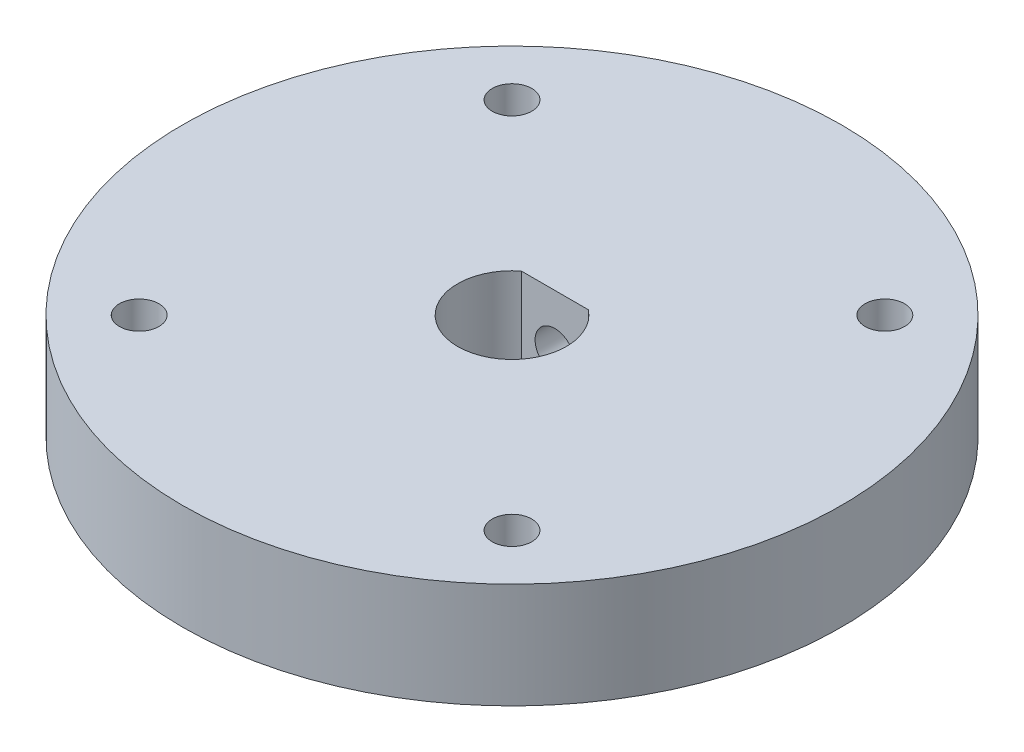
ISO-10303-21;
HEADER;
FILE_DESCRIPTION(('STEP AP214'),'2;1');
FILE_NAME('part.step','',(''),(''),'','','');
FILE_SCHEMA(('AUTOMOTIVE_DESIGN { 1 0 10303 214 1 1 1 1 }'));
ENDSEC;
DATA;
#1=APPLICATION_CONTEXT('core data for automotive mechanical design processes');
#2=APPLICATION_PROTOCOL_DEFINITION('international standard','automotive_design',2000,#1);
#3=PRODUCT_CONTEXT('',#1,'mechanical');
#4=PRODUCT('Part','Part','',(#3));
#5=PRODUCT_RELATED_PRODUCT_CATEGORY('part','',(#4));
#6=PRODUCT_DEFINITION_FORMATION('','',#4);
#7=PRODUCT_DEFINITION_CONTEXT('part definition',#1,'design');
#8=PRODUCT_DEFINITION('design','',#6,#7);
#9=PRODUCT_DEFINITION_SHAPE('','',#8);
#10=(LENGTH_UNIT() NAMED_UNIT(*) SI_UNIT(.MILLI.,.METRE.));
#11=(NAMED_UNIT(*) PLANE_ANGLE_UNIT() SI_UNIT($,.RADIAN.));
#12=(NAMED_UNIT(*) SI_UNIT($,.STERADIAN.) SOLID_ANGLE_UNIT());
#13=UNCERTAINTY_MEASURE_WITH_UNIT(LENGTH_MEASURE(1.E-05),#10,'distance_accuracy_value','');
#14=(GEOMETRIC_REPRESENTATION_CONTEXT(3) GLOBAL_UNCERTAINTY_ASSIGNED_CONTEXT((#13)) GLOBAL_UNIT_ASSIGNED_CONTEXT((#10,
#11,#12)) REPRESENTATION_CONTEXT('',''));
#15=CARTESIAN_POINT('',(0.,0.,0.));
#16=DIRECTION('',(0.,0.,1.));
#17=DIRECTION('',(1.,0.,0.));
#18=AXIS2_PLACEMENT_3D('',#15,#16,#17);
#19=CARTESIAN_POINT('',(0.,8.,0.));
#20=DIRECTION('',(0.,-1.,0.));
#21=DIRECTION('',(0.,0.,-1.));
#22=AXIS2_PLACEMENT_3D('',#19,#20,#21);
#23=CYLINDRICAL_SURFACE('',#22,25.);
#24=CARTESIAN_POINT('',(0.,0.,0.));
#25=DIRECTION('',(0.,1.,0.));
#26=DIRECTION('',(0.,0.,1.));
#27=AXIS2_PLACEMENT_3D('',#24,#25,#26);
#28=CIRCLE('',#27,25.);
#29=CARTESIAN_POINT('',(0.,0.,25.));
#30=VERTEX_POINT('',#29);
#31=EDGE_CURVE('E53',#30,#30,#28,.T.);
#32=ORIENTED_EDGE('',*,*,#31,.T.);
#33=EDGE_LOOP('',(#32));
#34=FACE_BOUND('',#33,.T.);
#35=CARTESIAN_POINT('',(0.,8.,0.));
#36=DIRECTION('',(0.,1.,0.));
#37=DIRECTION('',(0.,0.,1.));
#38=AXIS2_PLACEMENT_3D('',#35,#36,#37);
#39=CIRCLE('',#38,25.);
#40=CARTESIAN_POINT('',(0.,8.,25.));
#41=VERTEX_POINT('',#40);
#42=EDGE_CURVE('E11',#41,#41,#39,.T.);
#43=ORIENTED_EDGE('',*,*,#42,.F.);
#44=EDGE_LOOP('',(#43));
#45=FACE_BOUND('',#44,.T.);
#46=CARTESIAN_POINT('',(0.,6.5403001791127,-25.));
#47=CARTESIAN_POINT('',(0.142296173163742,6.540294023206,-24.9999983385396));
#48=CARTESIAN_POINT('',(0.284686127401418,6.52830373562857,-24.99877220319));
#49=CARTESIAN_POINT('',(0.565517585096987,6.48065361274378,-24.9939988119328));
#50=CARTESIAN_POINT('',(0.703954577212125,6.44496777899313,-24.9904490065857));
#51=CARTESIAN_POINT('',(0.972772794523899,6.35097689727402,-24.9814289381469));
#52=CARTESIAN_POINT('',(1.10315886168489,6.29268560128362,-24.9759598428425));
#53=CARTESIAN_POINT('',(1.35226813750984,6.15516536865815,-24.9637125453824));
#54=CARTESIAN_POINT('',(1.47099364048516,6.07594056222888,-24.9569346015349));
#55=CARTESIAN_POINT('',(1.69388023038557,5.89848689257549,-24.9428006047637));
#56=CARTESIAN_POINT('',(1.7979919813956,5.80019620229791,-24.9354427185724));
#57=CARTESIAN_POINT('',(1.98827163016278,5.58753281046018,-24.9209932540018));
#58=CARTESIAN_POINT('',(2.07443869331246,5.47315936130516,-24.9139016880215));
#59=CARTESIAN_POINT('',(2.22655827675972,5.23126759400491,-24.9007690946797));
#60=CARTESIAN_POINT('',(2.29246605736723,5.10372100240584,-24.8947304049813));
#61=CARTESIAN_POINT('',(2.40191051525527,4.83929947985331,-24.8844100920088));
#62=CARTESIAN_POINT('',(2.44544776214454,4.70242478651677,-24.8801284239973));
#63=CARTESIAN_POINT('',(2.50876880713539,4.42373613976118,-24.8738235609723));
#64=CARTESIAN_POINT('',(2.52863452275869,4.28194097800913,-24.8717925789703));
#65=CARTESIAN_POINT('',(2.54430182767479,3.99701562167174,-24.8701948845832));
#66=CARTESIAN_POINT('',(2.54010406876178,3.85388546335156,-24.8706281054517));
#67=CARTESIAN_POINT('',(2.50783108659309,3.57091809625692,-24.8739027569794));
#68=CARTESIAN_POINT('',(2.47984535192711,3.4310705619905,-24.8767351619485));
#69=CARTESIAN_POINT('',(2.40093009467778,3.15806763051647,-24.8844749426093));
#70=CARTESIAN_POINT('',(2.35000025309315,3.02491232638229,-24.8893823471506));
#71=CARTESIAN_POINT('',(2.22654386588512,2.76879122991967,-24.9007295614281));
#72=CARTESIAN_POINT('',(2.15397766450597,2.6458446821247,-24.9071721805589));
#73=CARTESIAN_POINT('',(1.98933693424774,2.41384170605886,-24.9208615369364));
#74=CARTESIAN_POINT('',(1.89726181573716,2.30478569777095,-24.9281082984841));
#75=CARTESIAN_POINT('',(1.69571733393291,2.10313951985693,-24.942629622861));
#76=CARTESIAN_POINT('',(1.58617069473245,2.01062656789319,-24.9499041620718));
#77=CARTESIAN_POINT('',(1.35306100050723,1.84529126090176,-24.9636302454488));
#78=CARTESIAN_POINT('',(1.22949792898245,1.77246892905401,-24.9700817886462));
#79=CARTESIAN_POINT('',(0.971809023101519,1.64858493639978,-24.981437184215));
#80=CARTESIAN_POINT('',(0.83768126653888,1.59752724647775,-24.9863407541217));
#81=CARTESIAN_POINT('',(0.562695845938416,1.51867874241371,-24.994044838092));
#82=CARTESIAN_POINT('',(0.421838389857855,1.49088720980537,-24.9968454170963));
#83=CARTESIAN_POINT('',(0.138060644344315,1.45945800298242,-25.0000196196596));
#84=CARTESIAN_POINT('',(-0.00484773025709483,1.45571378474179,-25.0004039484959));
#85=CARTESIAN_POINT('',(-0.2892577212237,1.4722055787322,-24.9987310638568));
#86=CARTESIAN_POINT('',(-0.430759357194882,1.49244125627702,-24.9966738844572));
#87=CARTESIAN_POINT('',(-0.708031244601215,1.5562300277586,-24.9903559933151));
#88=CARTESIAN_POINT('',(-0.843813101651551,1.5997331823807,-24.9861000015779));
#89=CARTESIAN_POINT('',(-1.10615196773859,1.70877065666869,-24.9758618917787));
#90=CARTESIAN_POINT('',(-1.2327087635175,1.7743054854493,-24.9698797338285));
#91=CARTESIAN_POINT('',(-1.4734864035579,1.92580986963512,-24.9568316343041));
#92=CARTESIAN_POINT('',(-1.58766303803267,2.01184936325064,-24.9497620134835));
#93=CARTESIAN_POINT('',(-1.79999165488946,2.20182052943254,-24.9353439370307));
#94=CARTESIAN_POINT('',(-1.89814322162904,2.30575266593711,-24.9279954741723));
#95=CARTESIAN_POINT('',(-2.07600594404032,2.52902401135919,-24.9138156756389));
#96=CARTESIAN_POINT('',(-2.15564713350089,2.64841910367593,-24.906986365655));
#97=CARTESIAN_POINT('',(-2.29374726258629,2.898951795116,-24.8946490445467));
#98=CARTESIAN_POINT('',(-2.35220649999214,3.03008922913031,-24.8891410148478));
#99=CARTESIAN_POINT('',(-2.44616637423158,3.30014497013413,-24.8800825847812));
#100=CARTESIAN_POINT('',(-2.48170851426286,3.43904871343549,-24.8765286472534));
#101=CARTESIAN_POINT('',(-2.52895988977141,3.72089048823332,-24.8717698380494));
#102=CARTESIAN_POINT('',(-2.54066983300974,3.86382839979652,-24.8705648966135));
#103=CARTESIAN_POINT('',(-2.5399144068568,4.14898557622737,-24.8706420026341));
#104=CARTESIAN_POINT('',(-2.52755894520311,4.29120514807172,-24.8719127435494));
#105=CARTESIAN_POINT('',(-2.47925401313301,4.57153699199068,-24.8767739127993));
#106=CARTESIAN_POINT('',(-2.44330451733255,4.7096492596462,-24.8803643436296));
#107=CARTESIAN_POINT('',(-2.34886255647417,4.97784436608672,-24.8894571824873));
#108=CARTESIAN_POINT('',(-2.2903734392122,5.10792839397388,-24.8949593065602));
#109=CARTESIAN_POINT('',(-2.15252382001654,5.35645062393997,-24.9072561459216));
#110=CARTESIAN_POINT('',(-2.07316341275773,5.47488887884229,-24.9140508553466));
#111=CARTESIAN_POINT('',(-1.8954114441295,5.6973207609155,-24.928204446376));
#112=CARTESIAN_POINT('',(-1.79693796890177,5.80124878099475,-24.9355656709006));
#113=CARTESIAN_POINT('',(-1.58391803230031,5.991153188596,-24.9500015072705));
#114=CARTESIAN_POINT('',(-1.46936773040669,6.07712527446075,-24.9570760501098));
#115=CARTESIAN_POINT('',(-1.2271201270444,6.22885352375491,-24.9701605375219));
#116=CARTESIAN_POINT('',(-1.09938954628952,6.29455675621915,-24.9761676775939));
#117=CARTESIAN_POINT('',(-0.834728662450881,6.40349463024192,-24.9864101874646));
#118=CARTESIAN_POINT('',(-0.697808907501244,6.44675455235564,-24.9906475497194));
#119=CARTESIAN_POINT('',(-0.466764791805179,6.49881571128828,-24.9958108407278));
#120=CARTESIAN_POINT('',(-0.374116304635257,6.514351068132,-24.9973744311634));
#121=CARTESIAN_POINT('',(-0.187658806295788,6.53509530991178,-24.9994695564832));
#122=CARTESIAN_POINT('',(-0.0938498001090526,6.54030423916998,-25.0000010957971));
#123=CARTESIAN_POINT('',(0.,6.5403001791127,-25.));
#124=B_SPLINE_CURVE_WITH_KNOTS('',3,(#46,#47,#48,#49,#50,#51,#52,#53,#54,#55,#56,#57,#58,#59,
#60,#61,#62,#63,#64,#65,#66,#67,#68,#69,#70,#71,#72,#73,#74,#75,#76,#77,#78,#79,#80,#81,#82,#83,
#84,#85,#86,#87,#88,#89,#90,#91,#92,#93,#94,#95,#96,#97,#98,#99,#100,#101,#102,#103,#104,#105,
#106,#107,#108,#109,#110,#111,#112,#113,#114,#115,#116,#117,#118,#119,#120,#121,#122,#123),
.UNSPECIFIED.,.T.,.F.,(4,2,2,2,2,2,2,2,2,2,2,2,2,2,2,2,2,2,2,2,2,2,2,2,2,2,2,2,2,2,2,2,2,2,2,2,
2,2,4),(0.,0.42654580946566,0.8535603944395,1.2803156126085,1.7069866942707,2.13506524621548,
2.56316370365006,2.99220087287207,3.42122711721235,3.8487643243204,4.27628995101641,
4.70221434024446,5.12814465145593,5.55486046991908,5.98158918714992,6.41026050665011,
6.83893233078312,7.26768233118449,7.69641909116091,8.12325497205539,8.55008489569268,
8.97600236309114,9.40192967339815,9.82933108896018,10.2567435882793,10.6857462766038,
11.11474293367,11.5429604730357,11.9711652951463,12.3974190723693,12.8236733081855,
13.2498642571119,13.6760532728141,14.1041108532375,14.5322708649911,14.961539707907,
15.3903239589172,15.6716485362768,15.9529719061586),.UNSPECIFIED.);
#125=CARTESIAN_POINT('',(0.,6.5403001791127,-25.));
#126=VERTEX_POINT('',#125);
#127=EDGE_CURVE('E43',#126,#126,#124,.T.);
#128=ORIENTED_EDGE('',*,*,#127,.F.);
#129=EDGE_LOOP('',(#128));
#130=FACE_BOUND('',#129,.T.);
#131=ADVANCED_FACE('F39',(#34,#45,#130),#23,.T.);
#132=CARTESIAN_POINT('',(0.,8.,0.));
#133=DIRECTION('',(0.,1.,0.));
#134=DIRECTION('',(0.,0.,1.));
#135=AXIS2_PLACEMENT_3D('',#132,#133,#134);
#136=PLANE('',#135);
#137=CARTESIAN_POINT('',(14.1421356237311,8.,-14.1421356237308));
#138=DIRECTION('',(0.,1.,0.));
#139=DIRECTION('',(0.,0.,1.));
#140=AXIS2_PLACEMENT_3D('',#137,#138,#139);
#141=CIRCLE('',#140,1.5);
#142=CARTESIAN_POINT('',(14.1421356237311,8.,-12.6421356237308));
#143=VERTEX_POINT('',#142);
#144=EDGE_CURVE('E130',#143,#143,#141,.T.);
#145=ORIENTED_EDGE('',*,*,#144,.F.);
#146=EDGE_LOOP('',(#145));
#147=FACE_BOUND('',#146,.T.);
#148=CARTESIAN_POINT('',(-14.142135623731,8.,14.1421356237309));
#149=DIRECTION('',(0.,1.,0.));
#150=DIRECTION('',(0.,0.,1.));
#151=AXIS2_PLACEMENT_3D('',#148,#149,#150);
#152=CIRCLE('',#151,1.5);
#153=CARTESIAN_POINT('',(-14.142135623731,8.,15.6421356237309));
#154=VERTEX_POINT('',#153);
#155=EDGE_CURVE('E89',#154,#154,#152,.T.);
#156=ORIENTED_EDGE('',*,*,#155,.F.);
#157=EDGE_LOOP('',(#156));
#158=FACE_BOUND('',#157,.T.);
#159=ORIENTED_EDGE('',*,*,#42,.T.);
#160=EDGE_LOOP('',(#159));
#161=FACE_BOUND('',#160,.T.);
#162=DIRECTION('',(-1.,0.,0.));
#163=VECTOR('',#162,1.);
#164=CARTESIAN_POINT('',(2.5403001791127,8.,-3.25));
#165=LINE('',#164,#163);
#166=CARTESIAN_POINT('',(2.5403001791127,8.,-3.25));
#167=VERTEX_POINT('',#166);
#168=CARTESIAN_POINT('',(-2.5403001791127,8.,-3.25));
#169=VERTEX_POINT('',#168);
#170=EDGE_CURVE('E96',#167,#169,#165,.T.);
#171=ORIENTED_EDGE('',*,*,#170,.F.);
#172=CARTESIAN_POINT('',(0.,8.,0.));
#173=DIRECTION('',(0.,1.,0.));
#174=DIRECTION('',(0.,0.,1.));
#175=AXIS2_PLACEMENT_3D('',#172,#173,#174);
#176=CIRCLE('',#175,4.125);
#177=EDGE_CURVE('E79',#169,#167,#176,.T.);
#178=ORIENTED_EDGE('',*,*,#177,.F.);
#179=EDGE_LOOP('',(#171,#178));
#180=FACE_BOUND('',#179,.T.);
#181=CARTESIAN_POINT('',(-14.1421356237309,8.,-14.142135623731));
#182=DIRECTION('',(0.,1.,0.));
#183=DIRECTION('',(0.,0.,1.));
#184=AXIS2_PLACEMENT_3D('',#181,#182,#183);
#185=CIRCLE('',#184,1.5);
#186=CARTESIAN_POINT('',(-14.1421356237309,8.,-12.642135623731));
#187=VERTEX_POINT('',#186);
#188=EDGE_CURVE('E138',#187,#187,#185,.T.);
#189=ORIENTED_EDGE('',*,*,#188,.F.);
#190=EDGE_LOOP('',(#189));
#191=FACE_BOUND('',#190,.T.);
#192=CARTESIAN_POINT('',(14.1421356237308,8.,14.1421356237311));
#193=DIRECTION('',(0.,1.,0.));
#194=DIRECTION('',(0.,0.,1.));
#195=AXIS2_PLACEMENT_3D('',#192,#193,#194);
#196=CIRCLE('',#195,1.5);
#197=CARTESIAN_POINT('',(14.1421356237308,8.,15.6421356237311));
#198=VERTEX_POINT('',#197);
#199=EDGE_CURVE('E122',#198,#198,#196,.T.);
#200=ORIENTED_EDGE('',*,*,#199,.F.);
#201=EDGE_LOOP('',(#200));
#202=FACE_BOUND('',#201,.T.);
#203=ADVANCED_FACE('F150',(#147,#158,#161,#180,#191,#202),#136,.T.);
#204=CARTESIAN_POINT('',(0.,0.,0.));
#205=DIRECTION('',(0.,1.,0.));
#206=DIRECTION('',(0.,0.,1.));
#207=AXIS2_PLACEMENT_3D('',#204,#205,#206);
#208=PLANE('',#207);
#209=ORIENTED_EDGE('',*,*,#31,.F.);
#210=EDGE_LOOP('',(#209));
#211=FACE_BOUND('',#210,.T.);
#212=CARTESIAN_POINT('',(0.,0.,0.));
#213=DIRECTION('',(0.,1.,0.));
#214=DIRECTION('',(0.,0.,1.));
#215=AXIS2_PLACEMENT_3D('',#212,#213,#214);
#216=CIRCLE('',#215,4.125);
#217=CARTESIAN_POINT('',(-2.5403001791127,0.,-3.25));
#218=VERTEX_POINT('',#217);
#219=CARTESIAN_POINT('',(2.5403001791127,0.,-3.25));
#220=VERTEX_POINT('',#219);
#221=EDGE_CURVE('E68',#218,#220,#216,.T.);
#222=ORIENTED_EDGE('',*,*,#221,.T.);
#223=DIRECTION('',(-1.,0.,0.));
#224=VECTOR('',#223,1.);
#225=CARTESIAN_POINT('',(2.5403001791127,0.,-3.25));
#226=LINE('',#225,#224);
#227=EDGE_CURVE('E74',#220,#218,#226,.T.);
#228=ORIENTED_EDGE('',*,*,#227,.T.);
#229=EDGE_LOOP('',(#222,#228));
#230=FACE_BOUND('',#229,.T.);
#231=CARTESIAN_POINT('',(-14.142135623731,0.,14.1421356237309));
#232=DIRECTION('',(0.,1.,0.));
#233=DIRECTION('',(0.,0.,1.));
#234=AXIS2_PLACEMENT_3D('',#231,#232,#233);
#235=CIRCLE('',#234,1.5);
#236=CARTESIAN_POINT('',(-14.142135623731,0.,15.6421356237309));
#237=VERTEX_POINT('',#236);
#238=EDGE_CURVE('E93',#237,#237,#235,.T.);
#239=ORIENTED_EDGE('',*,*,#238,.T.);
#240=EDGE_LOOP('',(#239));
#241=FACE_BOUND('',#240,.T.);
#242=CARTESIAN_POINT('',(-14.1421356237309,0.,-14.142135623731));
#243=DIRECTION('',(0.,1.,0.));
#244=DIRECTION('',(0.,0.,1.));
#245=AXIS2_PLACEMENT_3D('',#242,#243,#244);
#246=CIRCLE('',#245,1.5);
#247=CARTESIAN_POINT('',(-14.1421356237309,0.,-12.642135623731));
#248=VERTEX_POINT('',#247);
#249=EDGE_CURVE('E134',#248,#248,#246,.T.);
#250=ORIENTED_EDGE('',*,*,#249,.T.);
#251=EDGE_LOOP('',(#250));
#252=FACE_BOUND('',#251,.T.);
#253=CARTESIAN_POINT('',(14.1421356237311,0.,-14.1421356237308));
#254=DIRECTION('',(0.,1.,0.));
#255=DIRECTION('',(0.,0.,1.));
#256=AXIS2_PLACEMENT_3D('',#253,#254,#255);
#257=CIRCLE('',#256,1.5);
#258=CARTESIAN_POINT('',(14.1421356237311,0.,-12.6421356237308));
#259=VERTEX_POINT('',#258);
#260=EDGE_CURVE('E126',#259,#259,#257,.T.);
#261=ORIENTED_EDGE('',*,*,#260,.T.);
#262=EDGE_LOOP('',(#261));
#263=FACE_BOUND('',#262,.T.);
#264=CARTESIAN_POINT('',(14.1421356237308,0.,14.1421356237311));
#265=DIRECTION('',(0.,1.,0.));
#266=DIRECTION('',(0.,0.,1.));
#267=AXIS2_PLACEMENT_3D('',#264,#265,#266);
#268=CIRCLE('',#267,1.5);
#269=CARTESIAN_POINT('',(14.1421356237308,0.,15.6421356237311));
#270=VERTEX_POINT('',#269);
#271=EDGE_CURVE('E121',#270,#270,#268,.T.);
#272=ORIENTED_EDGE('',*,*,#271,.T.);
#273=EDGE_LOOP('',(#272));
#274=FACE_BOUND('',#273,.T.);
#275=ADVANCED_FACE('F86',(#211,#230,#241,#252,#263,#274),#208,.F.);
#276=CARTESIAN_POINT('',(0.,8.,0.));
#277=DIRECTION('',(0.,-1.,0.));
#278=DIRECTION('',(0.,0.,-1.));
#279=AXIS2_PLACEMENT_3D('',#276,#277,#278);
#280=CYLINDRICAL_SURFACE('',#279,4.125);
#281=ORIENTED_EDGE('',*,*,#221,.F.);
#282=DIRECTION('',(0.,-1.,0.));
#283=VECTOR('',#282,1.);
#284=CARTESIAN_POINT('',(-2.5403001791127,8.,-3.25));
#285=LINE('',#284,#283);
#286=EDGE_CURVE('E76',#169,#218,#285,.T.);
#287=ORIENTED_EDGE('',*,*,#286,.F.);
#288=ORIENTED_EDGE('',*,*,#177,.T.);
#289=DIRECTION('',(0.,-1.,0.));
#290=VECTOR('',#289,1.);
#291=CARTESIAN_POINT('',(2.5403001791127,8.,-3.25));
#292=LINE('',#291,#290);
#293=EDGE_CURVE('E61',#167,#220,#292,.T.);
#294=ORIENTED_EDGE('',*,*,#293,.T.);
#295=EDGE_LOOP('',(#281,#287,#288,#294));
#296=FACE_BOUND('',#295,.T.);
#297=ADVANCED_FACE('F81',(#296),#280,.F.);
#298=CARTESIAN_POINT('',(2.5403001791127,8.,-3.25));
#299=DIRECTION('',(0.,0.,1.));
#300=DIRECTION('',(1.,0.,0.));
#301=AXIS2_PLACEMENT_3D('',#298,#299,#300);
#302=PLANE('',#301);
#303=CARTESIAN_POINT('',(0.,4.,-3.25));
#304=DIRECTION('',(0.,0.,1.));
#305=DIRECTION('',(1.,0.,0.));
#306=AXIS2_PLACEMENT_3D('',#303,#304,#305);
#307=CIRCLE('',#306,1.5);
#308=CARTESIAN_POINT('',(1.5,4.,-3.25));
#309=VERTEX_POINT('',#308);
#310=EDGE_CURVE('E112',#309,#309,#307,.T.);
#311=ORIENTED_EDGE('',*,*,#310,.F.);
#312=EDGE_LOOP('',(#311));
#313=FACE_BOUND('',#312,.T.);
#314=ORIENTED_EDGE('',*,*,#227,.F.);
#315=ORIENTED_EDGE('',*,*,#293,.F.);
#316=ORIENTED_EDGE('',*,*,#170,.T.);
#317=ORIENTED_EDGE('',*,*,#286,.T.);
#318=EDGE_LOOP('',(#314,#315,#316,#317));
#319=FACE_BOUND('',#318,.T.);
#320=ADVANCED_FACE('F75',(#313,#319),#302,.T.);
#321=CARTESIAN_POINT('',(-14.142135623731,8.,14.1421356237309));
#322=DIRECTION('',(0.,-1.,0.));
#323=DIRECTION('',(0.,0.,-1.));
#324=AXIS2_PLACEMENT_3D('',#321,#322,#323);
#325=CYLINDRICAL_SURFACE('',#324,1.5);
#326=ORIENTED_EDGE('',*,*,#155,.T.);
#327=EDGE_LOOP('',(#326));
#328=FACE_BOUND('',#327,.T.);
#329=ORIENTED_EDGE('',*,*,#238,.F.);
#330=EDGE_LOOP('',(#329));
#331=FACE_BOUND('',#330,.T.);
#332=ADVANCED_FACE('F201',(#328,#331),#325,.F.);
#333=CARTESIAN_POINT('',(-14.1421356237309,8.,-14.142135623731));
#334=DIRECTION('',(0.,-1.,0.));
#335=DIRECTION('',(0.,0.,-1.));
#336=AXIS2_PLACEMENT_3D('',#333,#334,#335);
#337=CYLINDRICAL_SURFACE('',#336,1.5);
#338=ORIENTED_EDGE('',*,*,#188,.T.);
#339=EDGE_LOOP('',(#338));
#340=FACE_BOUND('',#339,.T.);
#341=ORIENTED_EDGE('',*,*,#249,.F.);
#342=EDGE_LOOP('',(#341));
#343=FACE_BOUND('',#342,.T.);
#344=ADVANCED_FACE('F197',(#340,#343),#337,.F.);
#345=CARTESIAN_POINT('',(14.1421356237311,8.,-14.1421356237308));
#346=DIRECTION('',(0.,-1.,0.));
#347=DIRECTION('',(0.,0.,-1.));
#348=AXIS2_PLACEMENT_3D('',#345,#346,#347);
#349=CYLINDRICAL_SURFACE('',#348,1.5);
#350=ORIENTED_EDGE('',*,*,#144,.T.);
#351=EDGE_LOOP('',(#350));
#352=FACE_BOUND('',#351,.T.);
#353=ORIENTED_EDGE('',*,*,#260,.F.);
#354=EDGE_LOOP('',(#353));
#355=FACE_BOUND('',#354,.T.);
#356=ADVANCED_FACE('F163',(#352,#355),#349,.F.);
#357=CARTESIAN_POINT('',(14.1421356237308,8.,14.1421356237311));
#358=DIRECTION('',(0.,-1.,0.));
#359=DIRECTION('',(0.,0.,-1.));
#360=AXIS2_PLACEMENT_3D('',#357,#358,#359);
#361=CYLINDRICAL_SURFACE('',#360,1.5);
#362=ORIENTED_EDGE('',*,*,#199,.T.);
#363=EDGE_LOOP('',(#362));
#364=FACE_BOUND('',#363,.T.);
#365=ORIENTED_EDGE('',*,*,#271,.F.);
#366=EDGE_LOOP('',(#365));
#367=FACE_BOUND('',#366,.T.);
#368=ADVANCED_FACE('F159',(#364,#367),#361,.F.);
#369=CARTESIAN_POINT('',(0.,4.,-38.25));
#370=DIRECTION('',(0.,0.,1.));
#371=DIRECTION('',(1.,0.,0.));
#372=AXIS2_PLACEMENT_3D('',#369,#370,#371);
#373=CYLINDRICAL_SURFACE('',#372,1.5);
#374=CARTESIAN_POINT('',(0.,4.,-22.));
#375=DIRECTION('',(0.,0.,1.));
#376=DIRECTION('',(1.,0.,0.));
#377=AXIS2_PLACEMENT_3D('',#374,#375,#376);
#378=CIRCLE('',#377,1.5);
#379=CARTESIAN_POINT('',(1.5,4.,-22.));
#380=VERTEX_POINT('',#379);
#381=EDGE_CURVE('E103',#380,#380,#378,.F.);
#382=ORIENTED_EDGE('',*,*,#381,.T.);
#383=EDGE_LOOP('',(#382));
#384=FACE_BOUND('',#383,.T.);
#385=ORIENTED_EDGE('',*,*,#310,.T.);
#386=EDGE_LOOP('',(#385));
#387=FACE_BOUND('',#386,.T.);
#388=ADVANCED_FACE('F162',(#384,#387),#373,.F.);
#389=CARTESIAN_POINT('',(0.,4.,-22.));
#390=DIRECTION('',(0.,0.,-1.));
#391=DIRECTION('',(-1.,0.,0.));
#392=AXIS2_PLACEMENT_3D('',#389,#390,#391);
#393=CYLINDRICAL_SURFACE('',#392,2.5403001791127);
#394=CARTESIAN_POINT('',(0.,4.,-22.));
#395=DIRECTION('',(0.,0.,1.));
#396=DIRECTION('',(1.,0.,0.));
#397=AXIS2_PLACEMENT_3D('',#394,#395,#396);
#398=CIRCLE('',#397,2.5403001791127);
#399=CARTESIAN_POINT('',(2.5403001791127,4.,-22.));
#400=VERTEX_POINT('',#399);
#401=EDGE_CURVE('E106',#400,#400,#398,.T.);
#402=ORIENTED_EDGE('',*,*,#401,.T.);
#403=EDGE_LOOP('',(#402));
#404=FACE_BOUND('',#403,.T.);
#405=ORIENTED_EDGE('',*,*,#127,.T.);
#406=EDGE_LOOP('',(#405));
#407=FACE_BOUND('',#406,.T.);
#408=ADVANCED_FACE('F183',(#404,#407),#393,.F.);
#409=CARTESIAN_POINT('',(0.,0.,-22.));
#410=DIRECTION('',(0.,0.,1.));
#411=DIRECTION('',(1.,0.,0.));
#412=AXIS2_PLACEMENT_3D('',#409,#410,#411);
#413=PLANE('',#412);
#414=ORIENTED_EDGE('',*,*,#401,.F.);
#415=EDGE_LOOP('',(#414));
#416=FACE_BOUND('',#415,.T.);
#417=ORIENTED_EDGE('',*,*,#381,.F.);
#418=EDGE_LOOP('',(#417));
#419=FACE_BOUND('',#418,.T.);
#420=ADVANCED_FACE('F185',(#416,#419),#413,.F.);
#421=CLOSED_SHELL('',(#131,#203,#275,#297,#320,#332,#344,#356,#368,#388,#408,#420));
#422=MANIFOLD_SOLID_BREP('B2',#421);
#423=ADVANCED_BREP_SHAPE_REPRESENTATION('',(#18,#422),#14);
#424=SHAPE_DEFINITION_REPRESENTATION(#9,#423);
ENDSEC;
END-ISO-10303-21;
